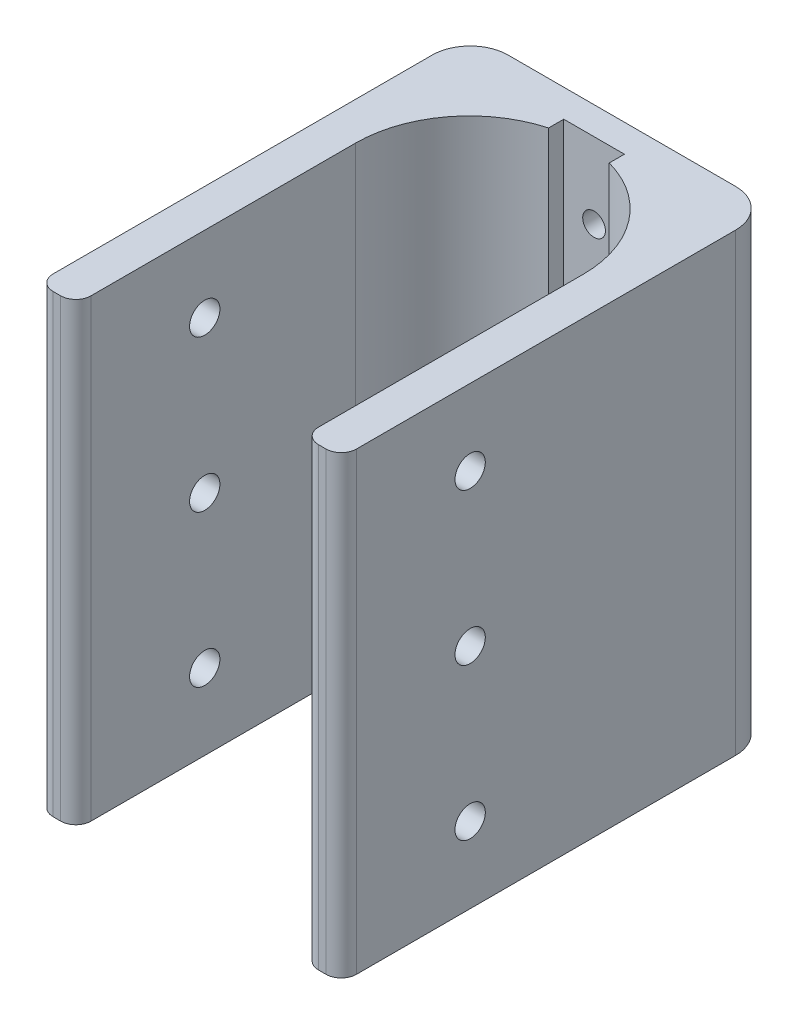
ISO-10303-21;
HEADER;
FILE_DESCRIPTION(('STEP AP214'),'2;1');
FILE_NAME('part.step','',(''),(''),'','','');
FILE_SCHEMA(('AUTOMOTIVE_DESIGN { 1 0 10303 214 1 1 1 1 }'));
ENDSEC;
DATA;
#1=APPLICATION_CONTEXT('core data for automotive mechanical design processes');
#2=APPLICATION_PROTOCOL_DEFINITION('international standard','automotive_design',2000,#1);
#3=PRODUCT_CONTEXT('',#1,'mechanical');
#4=PRODUCT('Part','Part','',(#3));
#5=PRODUCT_RELATED_PRODUCT_CATEGORY('part','',(#4));
#6=PRODUCT_DEFINITION_FORMATION('','',#4);
#7=PRODUCT_DEFINITION_CONTEXT('part definition',#1,'design');
#8=PRODUCT_DEFINITION('design','',#6,#7);
#9=PRODUCT_DEFINITION_SHAPE('','',#8);
#10=(LENGTH_UNIT() NAMED_UNIT(*) SI_UNIT(.MILLI.,.METRE.));
#11=(NAMED_UNIT(*) PLANE_ANGLE_UNIT() SI_UNIT($,.RADIAN.));
#12=(NAMED_UNIT(*) SI_UNIT($,.STERADIAN.) SOLID_ANGLE_UNIT());
#13=UNCERTAINTY_MEASURE_WITH_UNIT(LENGTH_MEASURE(1.E-05),#10,'distance_accuracy_value','');
#14=(GEOMETRIC_REPRESENTATION_CONTEXT(3) GLOBAL_UNCERTAINTY_ASSIGNED_CONTEXT((#13)) GLOBAL_UNIT_ASSIGNED_CONTEXT((#10,
#11,#12)) REPRESENTATION_CONTEXT('',''));
#15=CARTESIAN_POINT('',(0.,0.,0.));
#16=DIRECTION('',(0.,0.,1.));
#17=DIRECTION('',(1.,0.,0.));
#18=AXIS2_PLACEMENT_3D('',#15,#16,#17);
#19=CARTESIAN_POINT('',(0.,60.,42.9796640195393));
#20=DIRECTION('',(0.,0.,-1.));
#21=DIRECTION('',(-1.,0.,0.));
#22=AXIS2_PLACEMENT_3D('',#19,#20,#21);
#23=PLANE('',#22);
#24=DIRECTION('',(1.,0.,0.));
#25=VECTOR('',#24,1.);
#26=CARTESIAN_POINT('',(0.,0.,42.9796640195393));
#27=LINE('',#26,#25);
#28=CARTESIAN_POINT('',(-1.28866230415643,0.,42.9796640195393));
#29=VERTEX_POINT('',#28);
#30=CARTESIAN_POINT('',(-0.288662304156454,0.,42.9796640195393));
#31=VERTEX_POINT('',#30);
#32=EDGE_CURVE('E209',#29,#31,#27,.T.);
#33=ORIENTED_EDGE('',*,*,#32,.T.);
#34=DIRECTION('',(0.,-1.,0.));
#35=VECTOR('',#34,1.);
#36=CARTESIAN_POINT('',(-0.288662304156454,60.,42.9796640195393));
#37=LINE('',#36,#35);
#38=CARTESIAN_POINT('',(-0.288662304156454,60.,42.9796640195393));
#39=VERTEX_POINT('',#38);
#40=EDGE_CURVE('E13',#39,#31,#37,.T.);
#41=ORIENTED_EDGE('',*,*,#40,.F.);
#42=DIRECTION('',(1.,0.,0.));
#43=VECTOR('',#42,1.);
#44=CARTESIAN_POINT('',(0.,60.,42.9796640195393));
#45=LINE('',#44,#43);
#46=CARTESIAN_POINT('',(-1.28866230415643,60.,42.9796640195393));
#47=VERTEX_POINT('',#46);
#48=EDGE_CURVE('E253',#47,#39,#45,.T.);
#49=ORIENTED_EDGE('',*,*,#48,.F.);
#50=DIRECTION('',(0.,-1.,0.));
#51=VECTOR('',#50,1.);
#52=CARTESIAN_POINT('',(-1.28866230415643,60.,42.9796640195393));
#53=LINE('',#52,#51);
#54=EDGE_CURVE('E205',#47,#29,#53,.T.);
#55=ORIENTED_EDGE('',*,*,#54,.T.);
#56=EDGE_LOOP('',(#33,#41,#49,#55));
#57=FACE_BOUND('',#56,.T.);
#58=ADVANCED_FACE('F50',(#57),#23,.F.);
#59=CARTESIAN_POINT('',(-0.28866230415644,60.,40.9796640195393));
#60=DIRECTION('',(0.,-1.,0.));
#61=DIRECTION('',(0.,0.,-1.));
#62=AXIS2_PLACEMENT_3D('',#59,#60,#61);
#63=CYLINDRICAL_SURFACE('',#62,2.);
#64=CARTESIAN_POINT('',(-0.28866230415644,0.,40.9796640195393));
#65=DIRECTION('',(0.,1.,0.));
#66=DIRECTION('',(0.,0.,1.));
#67=AXIS2_PLACEMENT_3D('',#64,#65,#66);
#68=CIRCLE('',#67,2.);
#69=CARTESIAN_POINT('',(1.71133769584356,0.,40.9796640195393));
#70=VERTEX_POINT('',#69);
#71=EDGE_CURVE('E212',#31,#70,#68,.T.);
#72=ORIENTED_EDGE('',*,*,#71,.T.);
#73=DIRECTION('',(0.,-1.,0.));
#74=VECTOR('',#73,1.);
#75=CARTESIAN_POINT('',(1.71133769584356,60.,40.9796640195393));
#76=LINE('',#75,#74);
#77=CARTESIAN_POINT('',(1.71133769584356,60.,40.9796640195393));
#78=VERTEX_POINT('',#77);
#79=EDGE_CURVE('E59',#78,#70,#76,.T.);
#80=ORIENTED_EDGE('',*,*,#79,.F.);
#81=CARTESIAN_POINT('',(-0.28866230415644,60.,40.9796640195393));
#82=DIRECTION('',(0.,1.,0.));
#83=DIRECTION('',(0.,0.,1.));
#84=AXIS2_PLACEMENT_3D('',#81,#82,#83);
#85=CIRCLE('',#84,2.);
#86=EDGE_CURVE('E141',#39,#78,#85,.T.);
#87=ORIENTED_EDGE('',*,*,#86,.F.);
#88=ORIENTED_EDGE('',*,*,#40,.T.);
#89=EDGE_LOOP('',(#72,#80,#87,#88));
#90=FACE_BOUND('',#89,.T.);
#91=ADVANCED_FACE('F381',(#90),#63,.T.);
#92=CARTESIAN_POINT('',(1.71133769584356,60.,0.));
#93=DIRECTION('',(1.,0.,0.));
#94=DIRECTION('',(0.,0.,-1.));
#95=AXIS2_PLACEMENT_3D('',#92,#93,#94);
#96=PLANE('',#95);
#97=CARTESIAN_POINT('',(1.71133769584356,10.,25.9796640195393));
#98=DIRECTION('',(-1.,0.,0.));
#99=DIRECTION('',(0.,0.,1.));
#100=AXIS2_PLACEMENT_3D('',#97,#98,#99);
#101=CIRCLE('',#100,2.);
#102=CARTESIAN_POINT('',(1.71133769584356,10.,27.9796640195393));
#103=VERTEX_POINT('',#102);
#104=EDGE_CURVE('E289',#103,#103,#101,.T.);
#105=ORIENTED_EDGE('',*,*,#104,.T.);
#106=EDGE_LOOP('',(#105));
#107=FACE_BOUND('',#106,.T.);
#108=CARTESIAN_POINT('',(1.71133769584356,30.,25.9796640195393));
#109=DIRECTION('',(-1.,0.,0.));
#110=DIRECTION('',(0.,0.,1.));
#111=AXIS2_PLACEMENT_3D('',#108,#109,#110);
#112=CIRCLE('',#111,2.);
#113=CARTESIAN_POINT('',(1.71133769584356,30.,27.9796640195393));
#114=VERTEX_POINT('',#113);
#115=EDGE_CURVE('E468',#114,#114,#112,.T.);
#116=ORIENTED_EDGE('',*,*,#115,.T.);
#117=EDGE_LOOP('',(#116));
#118=FACE_BOUND('',#117,.T.);
#119=CARTESIAN_POINT('',(1.71133769584356,50.,25.9796640195393));
#120=DIRECTION('',(-1.,0.,0.));
#121=DIRECTION('',(0.,0.,1.));
#122=AXIS2_PLACEMENT_3D('',#119,#120,#121);
#123=CIRCLE('',#122,2.00000000000001);
#124=CARTESIAN_POINT('',(1.71133769584356,50.,27.9796640195393));
#125=VERTEX_POINT('',#124);
#126=EDGE_CURVE('E302',#125,#125,#123,.T.);
#127=ORIENTED_EDGE('',*,*,#126,.T.);
#128=EDGE_LOOP('',(#127));
#129=FACE_BOUND('',#128,.T.);
#130=DIRECTION('',(0.,0.,1.));
#131=VECTOR('',#130,1.);
#132=CARTESIAN_POINT('',(1.71133769584356,0.,0.));
#133=LINE('',#132,#131);
#134=CARTESIAN_POINT('',(1.71133769584356,0.,-9.02033598046068));
#135=VERTEX_POINT('',#134);
#136=EDGE_CURVE('E216',#135,#70,#133,.T.);
#137=ORIENTED_EDGE('',*,*,#136,.F.);
#138=DIRECTION('',(0.,-1.,0.));
#139=VECTOR('',#138,1.);
#140=CARTESIAN_POINT('',(1.71133769584356,60.,-9.02033598046068));
#141=LINE('',#140,#139);
#142=CARTESIAN_POINT('',(1.71133769584356,60.,-9.02033598046068));
#143=VERTEX_POINT('',#142);
#144=EDGE_CURVE('E283',#143,#135,#141,.T.);
#145=ORIENTED_EDGE('',*,*,#144,.F.);
#146=DIRECTION('',(0.,0.,1.));
#147=VECTOR('',#146,1.);
#148=CARTESIAN_POINT('',(1.71133769584356,60.,0.));
#149=LINE('',#148,#147);
#150=EDGE_CURVE('E327',#143,#78,#149,.T.);
#151=ORIENTED_EDGE('',*,*,#150,.T.);
#152=ORIENTED_EDGE('',*,*,#79,.T.);
#153=EDGE_LOOP('',(#137,#145,#151,#152));
#154=FACE_BOUND('',#153,.T.);
#155=ADVANCED_FACE('F386',(#107,#118,#129,#154),#96,.T.);
#156=CARTESIAN_POINT('',(-3.28866230415644,60.,-9.02033598046072));
#157=DIRECTION('',(0.,-1.,0.));
#158=DIRECTION('',(0.,0.,-1.));
#159=AXIS2_PLACEMENT_3D('',#156,#157,#158);
#160=CYLINDRICAL_SURFACE('',#159,5.);
#161=CARTESIAN_POINT('',(-3.28866230415644,0.,-9.02033598046072));
#162=DIRECTION('',(0.,1.,0.));
#163=DIRECTION('',(0.,0.,1.));
#164=AXIS2_PLACEMENT_3D('',#161,#162,#163);
#165=CIRCLE('',#164,5.);
#166=CARTESIAN_POINT('',(-3.28866230415647,0.,-14.0203359804607));
#167=VERTEX_POINT('',#166);
#168=EDGE_CURVE('E219',#135,#167,#165,.T.);
#169=ORIENTED_EDGE('',*,*,#168,.T.);
#170=DIRECTION('',(0.,-1.,0.));
#171=VECTOR('',#170,1.);
#172=CARTESIAN_POINT('',(-3.28866230415647,60.,-14.0203359804607));
#173=LINE('',#172,#171);
#174=CARTESIAN_POINT('',(-3.28866230415647,60.,-14.0203359804607));
#175=VERTEX_POINT('',#174);
#176=EDGE_CURVE('E281',#175,#167,#173,.T.);
#177=ORIENTED_EDGE('',*,*,#176,.F.);
#178=CARTESIAN_POINT('',(-3.28866230415644,60.,-9.02033598046072));
#179=DIRECTION('',(0.,1.,0.));
#180=DIRECTION('',(0.,0.,1.));
#181=AXIS2_PLACEMENT_3D('',#178,#179,#180);
#182=CIRCLE('',#181,5.);
#183=EDGE_CURVE('E330',#143,#175,#182,.T.);
#184=ORIENTED_EDGE('',*,*,#183,.F.);
#185=ORIENTED_EDGE('',*,*,#144,.T.);
#186=EDGE_LOOP('',(#169,#177,#184,#185));
#187=FACE_BOUND('',#186,.T.);
#188=ADVANCED_FACE('F397',(#187),#160,.T.);
#189=CARTESIAN_POINT('',(0.,60.,-14.0203359804607));
#190=DIRECTION('',(0.,0.,-1.));
#191=DIRECTION('',(-1.,0.,0.));
#192=AXIS2_PLACEMENT_3D('',#189,#190,#191);
#193=PLANE('',#192);
#194=CARTESIAN_POINT('',(-18.2886623041564,50.,-14.0203359804607));
#195=DIRECTION('',(0.,0.,-1.));
#196=DIRECTION('',(-1.,0.,0.));
#197=AXIS2_PLACEMENT_3D('',#194,#195,#196);
#198=CIRCLE('',#197,1.5);
#199=CARTESIAN_POINT('',(-19.7886623041564,50.,-14.0203359804607));
#200=VERTEX_POINT('',#199);
#201=EDGE_CURVE('E213',#200,#200,#198,.T.);
#202=ORIENTED_EDGE('',*,*,#201,.F.);
#203=EDGE_LOOP('',(#202));
#204=FACE_BOUND('',#203,.T.);
#205=CARTESIAN_POINT('',(-18.2886623041564,30.,-14.0203359804607));
#206=DIRECTION('',(0.,0.,-1.));
#207=DIRECTION('',(-1.,0.,0.));
#208=AXIS2_PLACEMENT_3D('',#205,#206,#207);
#209=CIRCLE('',#208,1.5);
#210=CARTESIAN_POINT('',(-19.7886623041564,30.,-14.0203359804607));
#211=VERTEX_POINT('',#210);
#212=EDGE_CURVE('E320',#211,#211,#209,.T.);
#213=ORIENTED_EDGE('',*,*,#212,.F.);
#214=EDGE_LOOP('',(#213));
#215=FACE_BOUND('',#214,.T.);
#216=CARTESIAN_POINT('',(-18.2886623041564,10.,-14.0203359804607));
#217=DIRECTION('',(0.,0.,-1.));
#218=DIRECTION('',(-1.,0.,0.));
#219=AXIS2_PLACEMENT_3D('',#216,#217,#218);
#220=CIRCLE('',#219,1.5);
#221=CARTESIAN_POINT('',(-19.7886623041564,10.,-14.0203359804607));
#222=VERTEX_POINT('',#221);
#223=EDGE_CURVE('E312',#222,#222,#220,.T.);
#224=ORIENTED_EDGE('',*,*,#223,.F.);
#225=EDGE_LOOP('',(#224));
#226=FACE_BOUND('',#225,.T.);
#227=DIRECTION('',(1.,0.,0.));
#228=VECTOR('',#227,1.);
#229=CARTESIAN_POINT('',(0.,0.,-14.0203359804607));
#230=LINE('',#229,#228);
#231=CARTESIAN_POINT('',(-33.2886623041564,0.,-14.0203359804607));
#232=VERTEX_POINT('',#231);
#233=EDGE_CURVE('E222',#232,#167,#230,.T.);
#234=ORIENTED_EDGE('',*,*,#233,.F.);
#235=DIRECTION('',(0.,-1.,0.));
#236=VECTOR('',#235,1.);
#237=CARTESIAN_POINT('',(-33.2886623041564,60.,-14.0203359804607));
#238=LINE('',#237,#236);
#239=CARTESIAN_POINT('',(-33.2886623041564,60.,-14.0203359804607));
#240=VERTEX_POINT('',#239);
#241=EDGE_CURVE('E279',#240,#232,#238,.T.);
#242=ORIENTED_EDGE('',*,*,#241,.F.);
#243=DIRECTION('',(1.,0.,0.));
#244=VECTOR('',#243,1.);
#245=CARTESIAN_POINT('',(0.,60.,-14.0203359804607));
#246=LINE('',#245,#244);
#247=EDGE_CURVE('E332',#240,#175,#246,.T.);
#248=ORIENTED_EDGE('',*,*,#247,.T.);
#249=ORIENTED_EDGE('',*,*,#176,.T.);
#250=EDGE_LOOP('',(#234,#242,#248,#249));
#251=FACE_BOUND('',#250,.T.);
#252=ADVANCED_FACE('F400',(#204,#215,#226,#251),#193,.T.);
#253=CARTESIAN_POINT('',(-33.2886623041564,60.,-9.02033598046071));
#254=DIRECTION('',(0.,-1.,0.));
#255=DIRECTION('',(0.,0.,-1.));
#256=AXIS2_PLACEMENT_3D('',#253,#254,#255);
#257=CYLINDRICAL_SURFACE('',#256,5.);
#258=CARTESIAN_POINT('',(-33.2886623041564,0.,-9.02033598046071));
#259=DIRECTION('',(0.,1.,0.));
#260=DIRECTION('',(0.,0.,1.));
#261=AXIS2_PLACEMENT_3D('',#258,#259,#260);
#262=CIRCLE('',#261,5.);
#263=CARTESIAN_POINT('',(-38.2886623041564,0.,-9.02033598046067));
#264=VERTEX_POINT('',#263);
#265=EDGE_CURVE('E225',#232,#264,#262,.T.);
#266=ORIENTED_EDGE('',*,*,#265,.T.);
#267=DIRECTION('',(0.,-1.,0.));
#268=VECTOR('',#267,1.);
#269=CARTESIAN_POINT('',(-38.2886623041564,60.,-9.02033598046067));
#270=LINE('',#269,#268);
#271=CARTESIAN_POINT('',(-38.2886623041564,60.,-9.02033598046067));
#272=VERTEX_POINT('',#271);
#273=EDGE_CURVE('E276',#272,#264,#270,.T.);
#274=ORIENTED_EDGE('',*,*,#273,.F.);
#275=CARTESIAN_POINT('',(-33.2886623041564,60.,-9.02033598046071));
#276=DIRECTION('',(0.,1.,0.));
#277=DIRECTION('',(0.,0.,1.));
#278=AXIS2_PLACEMENT_3D('',#275,#276,#277);
#279=CIRCLE('',#278,5.);
#280=EDGE_CURVE('E335',#240,#272,#279,.T.);
#281=ORIENTED_EDGE('',*,*,#280,.F.);
#282=ORIENTED_EDGE('',*,*,#241,.T.);
#283=EDGE_LOOP('',(#266,#274,#281,#282));
#284=FACE_BOUND('',#283,.T.);
#285=ADVANCED_FACE('F405',(#284),#257,.T.);
#286=CARTESIAN_POINT('',(-38.2886623041564,60.,0.));
#287=DIRECTION('',(1.,0.,0.));
#288=DIRECTION('',(0.,0.,-1.));
#289=AXIS2_PLACEMENT_3D('',#286,#287,#288);
#290=PLANE('',#289);
#291=CARTESIAN_POINT('',(-38.2886623041564,10.,25.9796640195393));
#292=DIRECTION('',(-1.,0.,0.));
#293=DIRECTION('',(0.,0.,1.));
#294=AXIS2_PLACEMENT_3D('',#291,#292,#293);
#295=CIRCLE('',#294,2.);
#296=CARTESIAN_POINT('',(-38.2886623041564,10.,27.9796640195393));
#297=VERTEX_POINT('',#296);
#298=EDGE_CURVE('E481',#297,#297,#295,.T.);
#299=ORIENTED_EDGE('',*,*,#298,.F.);
#300=EDGE_LOOP('',(#299));
#301=FACE_BOUND('',#300,.T.);
#302=CARTESIAN_POINT('',(-38.2886623041564,30.,25.9796640195393));
#303=DIRECTION('',(-1.,0.,0.));
#304=DIRECTION('',(0.,0.,1.));
#305=AXIS2_PLACEMENT_3D('',#302,#303,#304);
#306=CIRCLE('',#305,2.);
#307=CARTESIAN_POINT('',(-38.2886623041564,30.,27.9796640195393));
#308=VERTEX_POINT('',#307);
#309=EDGE_CURVE('E476',#308,#308,#306,.T.);
#310=ORIENTED_EDGE('',*,*,#309,.F.);
#311=EDGE_LOOP('',(#310));
#312=FACE_BOUND('',#311,.T.);
#313=CARTESIAN_POINT('',(-38.2886623041564,50.,25.9796640195393));
#314=DIRECTION('',(-1.,0.,0.));
#315=DIRECTION('',(0.,0.,1.));
#316=AXIS2_PLACEMENT_3D('',#313,#314,#315);
#317=CIRCLE('',#316,2.00000000000001);
#318=CARTESIAN_POINT('',(-38.2886623041564,50.,27.9796640195393));
#319=VERTEX_POINT('',#318);
#320=EDGE_CURVE('E472',#319,#319,#317,.T.);
#321=ORIENTED_EDGE('',*,*,#320,.F.);
#322=EDGE_LOOP('',(#321));
#323=FACE_BOUND('',#322,.T.);
#324=DIRECTION('',(0.,0.,1.));
#325=VECTOR('',#324,1.);
#326=CARTESIAN_POINT('',(-38.2886623041564,0.,0.));
#327=LINE('',#326,#325);
#328=CARTESIAN_POINT('',(-38.2886623041564,0.,40.9796640195393));
#329=VERTEX_POINT('',#328);
#330=EDGE_CURVE('E227',#264,#329,#327,.T.);
#331=ORIENTED_EDGE('',*,*,#330,.T.);
#332=DIRECTION('',(0.,-1.,0.));
#333=VECTOR('',#332,1.);
#334=CARTESIAN_POINT('',(-38.2886623041564,60.,40.9796640195393));
#335=LINE('',#334,#333);
#336=CARTESIAN_POINT('',(-38.2886623041564,60.,40.9796640195393));
#337=VERTEX_POINT('',#336);
#338=EDGE_CURVE('E273',#337,#329,#335,.T.);
#339=ORIENTED_EDGE('',*,*,#338,.F.);
#340=DIRECTION('',(0.,0.,1.));
#341=VECTOR('',#340,1.);
#342=CARTESIAN_POINT('',(-38.2886623041564,60.,0.));
#343=LINE('',#342,#341);
#344=EDGE_CURVE('E337',#272,#337,#343,.T.);
#345=ORIENTED_EDGE('',*,*,#344,.F.);
#346=ORIENTED_EDGE('',*,*,#273,.T.);
#347=EDGE_LOOP('',(#331,#339,#345,#346));
#348=FACE_BOUND('',#347,.T.);
#349=ADVANCED_FACE('F411',(#301,#312,#323,#348),#290,.F.);
#350=CARTESIAN_POINT('',(-36.2886623041564,60.,40.9796640195393));
#351=DIRECTION('',(0.,-1.,0.));
#352=DIRECTION('',(0.,0.,-1.));
#353=AXIS2_PLACEMENT_3D('',#350,#351,#352);
#354=CYLINDRICAL_SURFACE('',#353,2.);
#355=CARTESIAN_POINT('',(-36.2886623041564,0.,40.9796640195393));
#356=DIRECTION('',(0.,1.,0.));
#357=DIRECTION('',(0.,0.,1.));
#358=AXIS2_PLACEMENT_3D('',#355,#356,#357);
#359=CIRCLE('',#358,2.);
#360=CARTESIAN_POINT('',(-36.2886623041564,0.,42.9796640195393));
#361=VERTEX_POINT('',#360);
#362=EDGE_CURVE('E229',#329,#361,#359,.T.);
#363=ORIENTED_EDGE('',*,*,#362,.T.);
#364=DIRECTION('',(0.,-1.,0.));
#365=VECTOR('',#364,1.);
#366=CARTESIAN_POINT('',(-36.2886623041564,60.,42.9796640195393));
#367=LINE('',#366,#365);
#368=CARTESIAN_POINT('',(-36.2886623041564,60.,42.9796640195393));
#369=VERTEX_POINT('',#368);
#370=EDGE_CURVE('E270',#369,#361,#367,.T.);
#371=ORIENTED_EDGE('',*,*,#370,.F.);
#372=CARTESIAN_POINT('',(-36.2886623041564,60.,40.9796640195393));
#373=DIRECTION('',(0.,1.,0.));
#374=DIRECTION('',(0.,0.,1.));
#375=AXIS2_PLACEMENT_3D('',#372,#373,#374);
#376=CIRCLE('',#375,2.);
#377=EDGE_CURVE('E339',#337,#369,#376,.T.);
#378=ORIENTED_EDGE('',*,*,#377,.F.);
#379=ORIENTED_EDGE('',*,*,#338,.T.);
#380=EDGE_LOOP('',(#363,#371,#378,#379));
#381=FACE_BOUND('',#380,.T.);
#382=ADVANCED_FACE('F415',(#381),#354,.T.);
#383=CARTESIAN_POINT('',(0.,60.,42.9796640195393));
#384=DIRECTION('',(0.,0.,-1.));
#385=DIRECTION('',(-1.,0.,0.));
#386=AXIS2_PLACEMENT_3D('',#383,#384,#385);
#387=PLANE('',#386);
#388=DIRECTION('',(1.,0.,0.));
#389=VECTOR('',#388,1.);
#390=CARTESIAN_POINT('',(0.,0.,42.9796640195393));
#391=LINE('',#390,#389);
#392=CARTESIAN_POINT('',(-35.2886623041565,0.,42.9796640195393));
#393=VERTEX_POINT('',#392);
#394=EDGE_CURVE('E231',#361,#393,#391,.T.);
#395=ORIENTED_EDGE('',*,*,#394,.T.);
#396=DIRECTION('',(0.,-1.,0.));
#397=VECTOR('',#396,1.);
#398=CARTESIAN_POINT('',(-35.2886623041565,60.,42.9796640195393));
#399=LINE('',#398,#397);
#400=CARTESIAN_POINT('',(-35.2886623041565,60.,42.9796640195393));
#401=VERTEX_POINT('',#400);
#402=EDGE_CURVE('E268',#401,#393,#399,.T.);
#403=ORIENTED_EDGE('',*,*,#402,.F.);
#404=DIRECTION('',(1.,0.,0.));
#405=VECTOR('',#404,1.);
#406=CARTESIAN_POINT('',(0.,60.,42.9796640195393));
#407=LINE('',#406,#405);
#408=EDGE_CURVE('E341',#369,#401,#407,.T.);
#409=ORIENTED_EDGE('',*,*,#408,.F.);
#410=ORIENTED_EDGE('',*,*,#370,.T.);
#411=EDGE_LOOP('',(#395,#403,#409,#410));
#412=FACE_BOUND('',#411,.T.);
#413=ADVANCED_FACE('F420',(#412),#387,.F.);
#414=CARTESIAN_POINT('',(-35.2886623041564,60.,40.9796640195393));
#415=DIRECTION('',(0.,-1.,0.));
#416=DIRECTION('',(0.,0.,-1.));
#417=AXIS2_PLACEMENT_3D('',#414,#415,#416);
#418=CYLINDRICAL_SURFACE('',#417,2.);
#419=CARTESIAN_POINT('',(-35.2886623041564,0.,40.9796640195393));
#420=DIRECTION('',(0.,1.,0.));
#421=DIRECTION('',(0.,0.,1.));
#422=AXIS2_PLACEMENT_3D('',#419,#420,#421);
#423=CIRCLE('',#422,2.);
#424=CARTESIAN_POINT('',(-33.2886623041564,0.,40.9796640195393));
#425=VERTEX_POINT('',#424);
#426=EDGE_CURVE('E234',#425,#393,#423,.F.);
#427=ORIENTED_EDGE('',*,*,#426,.F.);
#428=DIRECTION('',(0.,-1.,0.));
#429=VECTOR('',#428,1.);
#430=CARTESIAN_POINT('',(-33.2886623041564,60.,40.9796640195393));
#431=LINE('',#430,#429);
#432=CARTESIAN_POINT('',(-33.2886623041564,60.,40.9796640195393));
#433=VERTEX_POINT('',#432);
#434=EDGE_CURVE('E266',#433,#425,#431,.T.);
#435=ORIENTED_EDGE('',*,*,#434,.F.);
#436=CARTESIAN_POINT('',(-35.2886623041564,60.,40.9796640195393));
#437=DIRECTION('',(0.,1.,0.));
#438=DIRECTION('',(0.,0.,1.));
#439=AXIS2_PLACEMENT_3D('',#436,#437,#438);
#440=CIRCLE('',#439,2.);
#441=EDGE_CURVE('E343',#433,#401,#440,.F.);
#442=ORIENTED_EDGE('',*,*,#441,.T.);
#443=ORIENTED_EDGE('',*,*,#402,.T.);
#444=EDGE_LOOP('',(#427,#435,#442,#443));
#445=FACE_BOUND('',#444,.T.);
#446=ADVANCED_FACE('F426',(#445),#418,.T.);
#447=CARTESIAN_POINT('',(-33.2886623041564,60.,0.));
#448=DIRECTION('',(-1.,0.,0.));
#449=DIRECTION('',(0.,0.,1.));
#450=AXIS2_PLACEMENT_3D('',#447,#448,#449);
#451=PLANE('',#450);
#452=CARTESIAN_POINT('',(-33.2886623041564,10.,25.9796640195393));
#453=DIRECTION('',(-1.,0.,0.));
#454=DIRECTION('',(0.,0.,1.));
#455=AXIS2_PLACEMENT_3D('',#452,#453,#454);
#456=CIRCLE('',#455,2.);
#457=CARTESIAN_POINT('',(-33.2886623041564,10.,27.9796640195393));
#458=VERTEX_POINT('',#457);
#459=EDGE_CURVE('E305',#458,#458,#456,.T.);
#460=ORIENTED_EDGE('',*,*,#459,.T.);
#461=EDGE_LOOP('',(#460));
#462=FACE_BOUND('',#461,.T.);
#463=CARTESIAN_POINT('',(-33.2886623041564,30.,25.9796640195393));
#464=DIRECTION('',(-1.,0.,0.));
#465=DIRECTION('',(0.,0.,1.));
#466=AXIS2_PLACEMENT_3D('',#463,#464,#465);
#467=CIRCLE('',#466,2.);
#468=CARTESIAN_POINT('',(-33.2886623041564,30.,27.9796640195393));
#469=VERTEX_POINT('',#468);
#470=EDGE_CURVE('E292',#469,#469,#467,.T.);
#471=ORIENTED_EDGE('',*,*,#470,.T.);
#472=EDGE_LOOP('',(#471));
#473=FACE_BOUND('',#472,.T.);
#474=CARTESIAN_POINT('',(-33.2886623041564,50.,25.9796640195393));
#475=DIRECTION('',(-1.,0.,0.));
#476=DIRECTION('',(0.,0.,1.));
#477=AXIS2_PLACEMENT_3D('',#474,#475,#476);
#478=CIRCLE('',#477,2.00000000000001);
#479=CARTESIAN_POINT('',(-33.2886623041564,50.,27.9796640195393));
#480=VERTEX_POINT('',#479);
#481=EDGE_CURVE('E288',#480,#480,#478,.T.);
#482=ORIENTED_EDGE('',*,*,#481,.T.);
#483=EDGE_LOOP('',(#482));
#484=FACE_BOUND('',#483,.T.);
#485=DIRECTION('',(0.,0.,-1.));
#486=VECTOR('',#485,1.);
#487=CARTESIAN_POINT('',(-33.2886623041564,0.,0.));
#488=LINE('',#487,#486);
#489=CARTESIAN_POINT('',(-33.2886623041564,0.,6.09314479035786));
#490=VERTEX_POINT('',#489);
#491=EDGE_CURVE('E237',#425,#490,#488,.T.);
#492=ORIENTED_EDGE('',*,*,#491,.T.);
#493=DIRECTION('',(0.,-1.,0.));
#494=VECTOR('',#493,1.);
#495=CARTESIAN_POINT('',(-33.2886623041564,60.,6.09314479035786));
#496=LINE('',#495,#494);
#497=CARTESIAN_POINT('',(-33.2886623041564,60.,6.09314479035786));
#498=VERTEX_POINT('',#497);
#499=EDGE_CURVE('E263',#498,#490,#496,.T.);
#500=ORIENTED_EDGE('',*,*,#499,.F.);
#501=DIRECTION('',(0.,0.,-1.));
#502=VECTOR('',#501,1.);
#503=CARTESIAN_POINT('',(-33.2886623041564,60.,0.));
#504=LINE('',#503,#502);
#505=EDGE_CURVE('E346',#433,#498,#504,.T.);
#506=ORIENTED_EDGE('',*,*,#505,.F.);
#507=ORIENTED_EDGE('',*,*,#434,.T.);
#508=EDGE_LOOP('',(#492,#500,#506,#507));
#509=FACE_BOUND('',#508,.T.);
#510=ADVANCED_FACE('F429',(#462,#473,#484,#509),#451,.F.);
#511=CARTESIAN_POINT('',(-18.2886623041564,60.,6.09314479035786));
#512=DIRECTION('',(0.,-1.,0.));
#513=DIRECTION('',(0.,0.,-1.));
#514=AXIS2_PLACEMENT_3D('',#511,#512,#513);
#515=CYLINDRICAL_SURFACE('',#514,15.);
#516=CARTESIAN_POINT('',(-18.2886623041564,0.,6.09314479035786));
#517=DIRECTION('',(0.,1.,0.));
#518=DIRECTION('',(0.,0.,1.));
#519=AXIS2_PLACEMENT_3D('',#516,#517,#518);
#520=CIRCLE('',#519,15.);
#521=CARTESIAN_POINT('',(-22.2886623041564,0.,-8.3636875044431));
#522=VERTEX_POINT('',#521);
#523=EDGE_CURVE('E239',#490,#522,#520,.F.);
#524=ORIENTED_EDGE('',*,*,#523,.T.);
#525=DIRECTION('',(0.,-1.,0.));
#526=VECTOR('',#525,1.);
#527=CARTESIAN_POINT('',(-22.2886623041564,60.,-8.3636875044431));
#528=LINE('',#527,#526);
#529=CARTESIAN_POINT('',(-22.2886623041564,60.,-8.3636875044431));
#530=VERTEX_POINT('',#529);
#531=EDGE_CURVE('E261',#530,#522,#528,.T.);
#532=ORIENTED_EDGE('',*,*,#531,.F.);
#533=CARTESIAN_POINT('',(-18.2886623041564,60.,6.09314479035786));
#534=DIRECTION('',(0.,1.,0.));
#535=DIRECTION('',(0.,0.,1.));
#536=AXIS2_PLACEMENT_3D('',#533,#534,#535);
#537=CIRCLE('',#536,15.);
#538=EDGE_CURVE('E348',#498,#530,#537,.F.);
#539=ORIENTED_EDGE('',*,*,#538,.F.);
#540=ORIENTED_EDGE('',*,*,#499,.T.);
#541=EDGE_LOOP('',(#524,#532,#539,#540));
#542=FACE_BOUND('',#541,.T.);
#543=ADVANCED_FACE('F431',(#542),#515,.F.);
#544=CARTESIAN_POINT('',(-22.2886623041565,60.,0.));
#545=DIRECTION('',(1.,0.,0.));
#546=DIRECTION('',(0.,0.,-1.));
#547=AXIS2_PLACEMENT_3D('',#544,#545,#546);
#548=PLANE('',#547);
#549=DIRECTION('',(0.,0.,1.));
#550=VECTOR('',#549,1.);
#551=CARTESIAN_POINT('',(-22.2886623041565,0.,0.));
#552=LINE('',#551,#550);
#553=CARTESIAN_POINT('',(-22.2886623041564,0.,-10.3636875044431));
#554=VERTEX_POINT('',#553);
#555=EDGE_CURVE('E242',#554,#522,#552,.T.);
#556=ORIENTED_EDGE('',*,*,#555,.F.);
#557=DIRECTION('',(0.,-1.,0.));
#558=VECTOR('',#557,1.);
#559=CARTESIAN_POINT('',(-22.2886623041564,60.,-10.3636875044431));
#560=LINE('',#559,#558);
#561=CARTESIAN_POINT('',(-22.2886623041564,60.,-10.3636875044431));
#562=VERTEX_POINT('',#561);
#563=EDGE_CURVE('E259',#562,#554,#560,.T.);
#564=ORIENTED_EDGE('',*,*,#563,.F.);
#565=DIRECTION('',(0.,0.,1.));
#566=VECTOR('',#565,1.);
#567=CARTESIAN_POINT('',(-22.2886623041565,60.,0.));
#568=LINE('',#567,#566);
#569=EDGE_CURVE('E350',#562,#530,#568,.T.);
#570=ORIENTED_EDGE('',*,*,#569,.T.);
#571=ORIENTED_EDGE('',*,*,#531,.T.);
#572=EDGE_LOOP('',(#556,#564,#570,#571));
#573=FACE_BOUND('',#572,.T.);
#574=ADVANCED_FACE('F363',(#573),#548,.T.);
#575=CARTESIAN_POINT('',(0.,60.,-10.3636875044431));
#576=DIRECTION('',(0.,0.,1.));
#577=DIRECTION('',(1.,0.,0.));
#578=AXIS2_PLACEMENT_3D('',#575,#576,#577);
#579=PLANE('',#578);
#580=CARTESIAN_POINT('',(-18.2886623041564,50.,-10.3636875044431));
#581=DIRECTION('',(0.,0.,1.));
#582=DIRECTION('',(1.,0.,0.));
#583=AXIS2_PLACEMENT_3D('',#580,#581,#582);
#584=CIRCLE('',#583,1.5);
#585=CARTESIAN_POINT('',(-16.7886623041564,50.,-10.3636875044431));
#586=VERTEX_POINT('',#585);
#587=EDGE_CURVE('E309',#586,#586,#584,.T.);
#588=ORIENTED_EDGE('',*,*,#587,.F.);
#589=EDGE_LOOP('',(#588));
#590=FACE_BOUND('',#589,.T.);
#591=CARTESIAN_POINT('',(-18.2886623041564,30.,-10.3636875044431));
#592=DIRECTION('',(0.,0.,1.));
#593=DIRECTION('',(1.,0.,0.));
#594=AXIS2_PLACEMENT_3D('',#591,#592,#593);
#595=CIRCLE('',#594,1.5);
#596=CARTESIAN_POINT('',(-16.7886623041564,30.,-10.3636875044431));
#597=VERTEX_POINT('',#596);
#598=EDGE_CURVE('E313',#597,#597,#595,.T.);
#599=ORIENTED_EDGE('',*,*,#598,.F.);
#600=EDGE_LOOP('',(#599));
#601=FACE_BOUND('',#600,.T.);
#602=CARTESIAN_POINT('',(-18.2886623041564,10.,-10.3636875044431));
#603=DIRECTION('',(0.,0.,1.));
#604=DIRECTION('',(1.,0.,0.));
#605=AXIS2_PLACEMENT_3D('',#602,#603,#604);
#606=CIRCLE('',#605,1.5);
#607=CARTESIAN_POINT('',(-16.7886623041564,10.,-10.3636875044431));
#608=VERTEX_POINT('',#607);
#609=EDGE_CURVE('E308',#608,#608,#606,.T.);
#610=ORIENTED_EDGE('',*,*,#609,.F.);
#611=EDGE_LOOP('',(#610));
#612=FACE_BOUND('',#611,.T.);
#613=DIRECTION('',(-1.,0.,0.));
#614=VECTOR('',#613,1.);
#615=CARTESIAN_POINT('',(0.,0.,-10.3636875044431));
#616=LINE('',#615,#614);
#617=CARTESIAN_POINT('',(-14.2886623041564,0.,-10.3636875044431));
#618=VERTEX_POINT('',#617);
#619=EDGE_CURVE('E245',#618,#554,#616,.T.);
#620=ORIENTED_EDGE('',*,*,#619,.F.);
#621=DIRECTION('',(0.,-1.,0.));
#622=VECTOR('',#621,1.);
#623=CARTESIAN_POINT('',(-14.2886623041564,60.,-10.3636875044431));
#624=LINE('',#623,#622);
#625=CARTESIAN_POINT('',(-14.2886623041564,60.,-10.3636875044431));
#626=VERTEX_POINT('',#625);
#627=EDGE_CURVE('E257',#626,#618,#624,.T.);
#628=ORIENTED_EDGE('',*,*,#627,.F.);
#629=DIRECTION('',(-1.,0.,0.));
#630=VECTOR('',#629,1.);
#631=CARTESIAN_POINT('',(0.,60.,-10.3636875044431));
#632=LINE('',#631,#630);
#633=EDGE_CURVE('E353',#626,#562,#632,.T.);
#634=ORIENTED_EDGE('',*,*,#633,.T.);
#635=ORIENTED_EDGE('',*,*,#563,.T.);
#636=EDGE_LOOP('',(#620,#628,#634,#635));
#637=FACE_BOUND('',#636,.T.);
#638=ADVANCED_FACE('F357',(#590,#601,#612,#637),#579,.T.);
#639=CARTESIAN_POINT('',(-14.2886623041564,60.,0.));
#640=DIRECTION('',(1.,0.,0.));
#641=DIRECTION('',(0.,0.,-1.));
#642=AXIS2_PLACEMENT_3D('',#639,#640,#641);
#643=PLANE('',#642);
#644=DIRECTION('',(0.,0.,1.));
#645=VECTOR('',#644,1.);
#646=CARTESIAN_POINT('',(-14.2886623041564,0.,0.));
#647=LINE('',#646,#645);
#648=CARTESIAN_POINT('',(-14.2886623041564,0.,-8.36368750444311));
#649=VERTEX_POINT('',#648);
#650=EDGE_CURVE('E248',#618,#649,#647,.T.);
#651=ORIENTED_EDGE('',*,*,#650,.T.);
#652=DIRECTION('',(0.,-1.,0.));
#653=VECTOR('',#652,1.);
#654=CARTESIAN_POINT('',(-14.2886623041564,60.,-8.36368750444311));
#655=LINE('',#654,#653);
#656=CARTESIAN_POINT('',(-14.2886623041564,60.,-8.36368750444311));
#657=VERTEX_POINT('',#656);
#658=EDGE_CURVE('E200',#657,#649,#655,.T.);
#659=ORIENTED_EDGE('',*,*,#658,.F.);
#660=DIRECTION('',(0.,0.,1.));
#661=VECTOR('',#660,1.);
#662=CARTESIAN_POINT('',(-14.2886623041564,60.,0.));
#663=LINE('',#662,#661);
#664=EDGE_CURVE('E191',#626,#657,#663,.T.);
#665=ORIENTED_EDGE('',*,*,#664,.F.);
#666=ORIENTED_EDGE('',*,*,#627,.T.);
#667=EDGE_LOOP('',(#651,#659,#665,#666));
#668=FACE_BOUND('',#667,.T.);
#669=ADVANCED_FACE('F370',(#668),#643,.F.);
#670=CARTESIAN_POINT('',(-18.2886623041564,60.,6.09314479035786));
#671=DIRECTION('',(0.,-1.,0.));
#672=DIRECTION('',(0.,0.,-1.));
#673=AXIS2_PLACEMENT_3D('',#670,#671,#672);
#674=CYLINDRICAL_SURFACE('',#673,15.);
#675=CARTESIAN_POINT('',(-18.2886623041564,0.,6.09314479035786));
#676=DIRECTION('',(0.,1.,0.));
#677=DIRECTION('',(0.,0.,1.));
#678=AXIS2_PLACEMENT_3D('',#675,#676,#677);
#679=CIRCLE('',#678,15.);
#680=CARTESIAN_POINT('',(-3.28866230415644,0.,6.09314479035786));
#681=VERTEX_POINT('',#680);
#682=EDGE_CURVE('E199',#649,#681,#679,.F.);
#683=ORIENTED_EDGE('',*,*,#682,.T.);
#684=DIRECTION('',(0.,-1.,0.));
#685=VECTOR('',#684,1.);
#686=CARTESIAN_POINT('',(-3.28866230415644,60.,6.09314479035786));
#687=LINE('',#686,#685);
#688=CARTESIAN_POINT('',(-3.28866230415644,60.,6.09314479035786));
#689=VERTEX_POINT('',#688);
#690=EDGE_CURVE('E196',#689,#681,#687,.T.);
#691=ORIENTED_EDGE('',*,*,#690,.F.);
#692=CARTESIAN_POINT('',(-18.2886623041564,60.,6.09314479035786));
#693=DIRECTION('',(0.,1.,0.));
#694=DIRECTION('',(0.,0.,1.));
#695=AXIS2_PLACEMENT_3D('',#692,#693,#694);
#696=CIRCLE('',#695,15.);
#697=EDGE_CURVE('E184',#657,#689,#696,.F.);
#698=ORIENTED_EDGE('',*,*,#697,.F.);
#699=ORIENTED_EDGE('',*,*,#658,.T.);
#700=EDGE_LOOP('',(#683,#691,#698,#699));
#701=FACE_BOUND('',#700,.T.);
#702=ADVANCED_FACE('F197',(#701),#674,.F.);
#703=CARTESIAN_POINT('',(-3.28866230415644,60.,0.));
#704=DIRECTION('',(1.,0.,0.));
#705=DIRECTION('',(0.,0.,-1.));
#706=AXIS2_PLACEMENT_3D('',#703,#704,#705);
#707=PLANE('',#706);
#708=CARTESIAN_POINT('',(-3.28866230415644,10.,25.9796640195393));
#709=DIRECTION('',(1.,0.,0.));
#710=DIRECTION('',(0.,0.,-1.));
#711=AXIS2_PLACEMENT_3D('',#708,#709,#710);
#712=CIRCLE('',#711,2.);
#713=CARTESIAN_POINT('',(-3.28866230415644,10.,23.9796640195393));
#714=VERTEX_POINT('',#713);
#715=EDGE_CURVE('E53',#714,#714,#712,.T.);
#716=ORIENTED_EDGE('',*,*,#715,.T.);
#717=EDGE_LOOP('',(#716));
#718=FACE_BOUND('',#717,.T.);
#719=CARTESIAN_POINT('',(-3.28866230415644,30.,25.9796640195393));
#720=DIRECTION('',(1.,0.,0.));
#721=DIRECTION('',(0.,0.,-1.));
#722=AXIS2_PLACEMENT_3D('',#719,#720,#721);
#723=CIRCLE('',#722,2.);
#724=CARTESIAN_POINT('',(-3.28866230415644,30.,23.9796640195393));
#725=VERTEX_POINT('',#724);
#726=EDGE_CURVE('E290',#725,#725,#723,.T.);
#727=ORIENTED_EDGE('',*,*,#726,.T.);
#728=EDGE_LOOP('',(#727));
#729=FACE_BOUND('',#728,.T.);
#730=CARTESIAN_POINT('',(-3.28866230415644,50.,25.9796640195393));
#731=DIRECTION('',(1.,0.,0.));
#732=DIRECTION('',(0.,0.,-1.));
#733=AXIS2_PLACEMENT_3D('',#730,#731,#732);
#734=CIRCLE('',#733,2.00000000000001);
#735=CARTESIAN_POINT('',(-3.28866230415644,50.,23.9796640195393));
#736=VERTEX_POINT('',#735);
#737=EDGE_CURVE('E286',#736,#736,#734,.T.);
#738=ORIENTED_EDGE('',*,*,#737,.T.);
#739=EDGE_LOOP('',(#738));
#740=FACE_BOUND('',#739,.T.);
#741=DIRECTION('',(0.,0.,1.));
#742=VECTOR('',#741,1.);
#743=CARTESIAN_POINT('',(-3.28866230415644,0.,0.));
#744=LINE('',#743,#742);
#745=CARTESIAN_POINT('',(-3.28866230415644,0.,40.9796640195393));
#746=VERTEX_POINT('',#745);
#747=EDGE_CURVE('E127',#681,#746,#744,.T.);
#748=ORIENTED_EDGE('',*,*,#747,.T.);
#749=DIRECTION('',(0.,-1.,0.));
#750=VECTOR('',#749,1.);
#751=CARTESIAN_POINT('',(-3.28866230415644,60.,40.9796640195393));
#752=LINE('',#751,#750);
#753=CARTESIAN_POINT('',(-3.28866230415644,60.,40.9796640195393));
#754=VERTEX_POINT('',#753);
#755=EDGE_CURVE('E201',#754,#746,#752,.T.);
#756=ORIENTED_EDGE('',*,*,#755,.F.);
#757=DIRECTION('',(0.,0.,1.));
#758=VECTOR('',#757,1.);
#759=CARTESIAN_POINT('',(-3.28866230415644,60.,0.));
#760=LINE('',#759,#758);
#761=EDGE_CURVE('E188',#689,#754,#760,.T.);
#762=ORIENTED_EDGE('',*,*,#761,.F.);
#763=ORIENTED_EDGE('',*,*,#690,.T.);
#764=EDGE_LOOP('',(#748,#756,#762,#763));
#765=FACE_BOUND('',#764,.T.);
#766=ADVANCED_FACE('F203',(#718,#729,#740,#765),#707,.F.);
#767=CARTESIAN_POINT('',(-1.28866230415644,60.,40.9796640195393));
#768=DIRECTION('',(0.,-1.,0.));
#769=DIRECTION('',(0.,0.,-1.));
#770=AXIS2_PLACEMENT_3D('',#767,#768,#769);
#771=CYLINDRICAL_SURFACE('',#770,2.);
#772=CARTESIAN_POINT('',(-1.28866230415644,0.,40.9796640195393));
#773=DIRECTION('',(0.,1.,0.));
#774=DIRECTION('',(0.,0.,1.));
#775=AXIS2_PLACEMENT_3D('',#772,#773,#774);
#776=CIRCLE('',#775,2.);
#777=EDGE_CURVE('E133',#746,#29,#776,.T.);
#778=ORIENTED_EDGE('',*,*,#777,.T.);
#779=ORIENTED_EDGE('',*,*,#54,.F.);
#780=CARTESIAN_POINT('',(-1.28866230415644,60.,40.9796640195393));
#781=DIRECTION('',(0.,1.,0.));
#782=DIRECTION('',(0.,0.,1.));
#783=AXIS2_PLACEMENT_3D('',#780,#781,#782);
#784=CIRCLE('',#783,2.);
#785=EDGE_CURVE('E68',#754,#47,#784,.T.);
#786=ORIENTED_EDGE('',*,*,#785,.F.);
#787=ORIENTED_EDGE('',*,*,#755,.T.);
#788=EDGE_LOOP('',(#778,#779,#786,#787));
#789=FACE_BOUND('',#788,.T.);
#790=ADVANCED_FACE('F534',(#789),#771,.T.);
#791=CARTESIAN_POINT('',(0.,60.,0.));
#792=DIRECTION('',(0.,1.,0.));
#793=DIRECTION('',(0.,0.,1.));
#794=AXIS2_PLACEMENT_3D('',#791,#792,#793);
#795=PLANE('',#794);
#796=ORIENTED_EDGE('',*,*,#48,.T.);
#797=ORIENTED_EDGE('',*,*,#86,.T.);
#798=ORIENTED_EDGE('',*,*,#150,.F.);
#799=ORIENTED_EDGE('',*,*,#183,.T.);
#800=ORIENTED_EDGE('',*,*,#247,.F.);
#801=ORIENTED_EDGE('',*,*,#280,.T.);
#802=ORIENTED_EDGE('',*,*,#344,.T.);
#803=ORIENTED_EDGE('',*,*,#377,.T.);
#804=ORIENTED_EDGE('',*,*,#408,.T.);
#805=ORIENTED_EDGE('',*,*,#441,.F.);
#806=ORIENTED_EDGE('',*,*,#505,.T.);
#807=ORIENTED_EDGE('',*,*,#538,.T.);
#808=ORIENTED_EDGE('',*,*,#569,.F.);
#809=ORIENTED_EDGE('',*,*,#633,.F.);
#810=ORIENTED_EDGE('',*,*,#664,.T.);
#811=ORIENTED_EDGE('',*,*,#697,.T.);
#812=ORIENTED_EDGE('',*,*,#761,.T.);
#813=ORIENTED_EDGE('',*,*,#785,.T.);
#814=EDGE_LOOP('',(#796,#797,#798,#799,#800,#801,#802,#803,#804,#805,#806,#807,#808,#809,#810,
#811,#812,#813));
#815=FACE_BOUND('',#814,.T.);
#816=ADVANCED_FACE('F186',(#815),#795,.T.);
#817=CARTESIAN_POINT('',(0.,0.,0.));
#818=DIRECTION('',(0.,1.,0.));
#819=DIRECTION('',(0.,0.,1.));
#820=AXIS2_PLACEMENT_3D('',#817,#818,#819);
#821=PLANE('',#820);
#822=ORIENTED_EDGE('',*,*,#32,.F.);
#823=ORIENTED_EDGE('',*,*,#777,.F.);
#824=ORIENTED_EDGE('',*,*,#747,.F.);
#825=ORIENTED_EDGE('',*,*,#682,.F.);
#826=ORIENTED_EDGE('',*,*,#650,.F.);
#827=ORIENTED_EDGE('',*,*,#619,.T.);
#828=ORIENTED_EDGE('',*,*,#555,.T.);
#829=ORIENTED_EDGE('',*,*,#523,.F.);
#830=ORIENTED_EDGE('',*,*,#491,.F.);
#831=ORIENTED_EDGE('',*,*,#426,.T.);
#832=ORIENTED_EDGE('',*,*,#394,.F.);
#833=ORIENTED_EDGE('',*,*,#362,.F.);
#834=ORIENTED_EDGE('',*,*,#330,.F.);
#835=ORIENTED_EDGE('',*,*,#265,.F.);
#836=ORIENTED_EDGE('',*,*,#233,.T.);
#837=ORIENTED_EDGE('',*,*,#168,.F.);
#838=ORIENTED_EDGE('',*,*,#136,.T.);
#839=ORIENTED_EDGE('',*,*,#71,.F.);
#840=EDGE_LOOP('',(#822,#823,#824,#825,#826,#827,#828,#829,#830,#831,#832,#833,#834,#835,#836,
#837,#838,#839));
#841=FACE_BOUND('',#840,.T.);
#842=ADVANCED_FACE('F368',(#841),#821,.F.);
#843=CARTESIAN_POINT('',(-18.2886623041564,10.,-20.3636875044431));
#844=DIRECTION('',(0.,0.,1.));
#845=DIRECTION('',(1.,0.,0.));
#846=AXIS2_PLACEMENT_3D('',#843,#844,#845);
#847=CYLINDRICAL_SURFACE('',#846,1.5);
#848=ORIENTED_EDGE('',*,*,#223,.T.);
#849=EDGE_LOOP('',(#848));
#850=FACE_BOUND('',#849,.T.);
#851=ORIENTED_EDGE('',*,*,#609,.T.);
#852=EDGE_LOOP('',(#851));
#853=FACE_BOUND('',#852,.T.);
#854=ADVANCED_FACE('F527',(#850,#853),#847,.F.);
#855=CARTESIAN_POINT('',(-18.2886623041564,30.,-20.3636875044431));
#856=DIRECTION('',(0.,0.,1.));
#857=DIRECTION('',(1.,0.,0.));
#858=AXIS2_PLACEMENT_3D('',#855,#856,#857);
#859=CYLINDRICAL_SURFACE('',#858,1.5);
#860=ORIENTED_EDGE('',*,*,#212,.T.);
#861=EDGE_LOOP('',(#860));
#862=FACE_BOUND('',#861,.T.);
#863=ORIENTED_EDGE('',*,*,#598,.T.);
#864=EDGE_LOOP('',(#863));
#865=FACE_BOUND('',#864,.T.);
#866=ADVANCED_FACE('F520',(#862,#865),#859,.F.);
#867=CARTESIAN_POINT('',(-18.2886623041564,50.,-20.3636875044431));
#868=DIRECTION('',(0.,0.,1.));
#869=DIRECTION('',(1.,0.,0.));
#870=AXIS2_PLACEMENT_3D('',#867,#868,#869);
#871=CYLINDRICAL_SURFACE('',#870,1.5);
#872=ORIENTED_EDGE('',*,*,#201,.T.);
#873=EDGE_LOOP('',(#872));
#874=FACE_BOUND('',#873,.T.);
#875=ORIENTED_EDGE('',*,*,#587,.T.);
#876=EDGE_LOOP('',(#875));
#877=FACE_BOUND('',#876,.T.);
#878=ADVANCED_FACE('F515',(#874,#877),#871,.F.);
#879=CARTESIAN_POINT('',(1.71133769584356,50.,25.9796640195393));
#880=DIRECTION('',(-1.,0.,0.));
#881=DIRECTION('',(0.,0.,1.));
#882=AXIS2_PLACEMENT_3D('',#879,#880,#881);
#883=CYLINDRICAL_SURFACE('',#882,2.00000000000001);
#884=ORIENTED_EDGE('',*,*,#126,.F.);
#885=EDGE_LOOP('',(#884));
#886=FACE_BOUND('',#885,.T.);
#887=ORIENTED_EDGE('',*,*,#737,.F.);
#888=EDGE_LOOP('',(#887));
#889=FACE_BOUND('',#888,.T.);
#890=ADVANCED_FACE('F507',(#886,#889),#883,.F.);
#891=CARTESIAN_POINT('',(1.71133769584356,30.,25.9796640195393));
#892=DIRECTION('',(-1.,0.,0.));
#893=DIRECTION('',(0.,0.,1.));
#894=AXIS2_PLACEMENT_3D('',#891,#892,#893);
#895=CYLINDRICAL_SURFACE('',#894,2.);
#896=ORIENTED_EDGE('',*,*,#115,.F.);
#897=EDGE_LOOP('',(#896));
#898=FACE_BOUND('',#897,.T.);
#899=ORIENTED_EDGE('',*,*,#726,.F.);
#900=EDGE_LOOP('',(#899));
#901=FACE_BOUND('',#900,.T.);
#902=ADVANCED_FACE('F497',(#898,#901),#895,.F.);
#903=CARTESIAN_POINT('',(1.71133769584356,10.,25.9796640195393));
#904=DIRECTION('',(-1.,0.,0.));
#905=DIRECTION('',(0.,0.,1.));
#906=AXIS2_PLACEMENT_3D('',#903,#904,#905);
#907=CYLINDRICAL_SURFACE('',#906,2.);
#908=ORIENTED_EDGE('',*,*,#104,.F.);
#909=EDGE_LOOP('',(#908));
#910=FACE_BOUND('',#909,.T.);
#911=ORIENTED_EDGE('',*,*,#715,.F.);
#912=EDGE_LOOP('',(#911));
#913=FACE_BOUND('',#912,.T.);
#914=ADVANCED_FACE('F505',(#910,#913),#907,.F.);
#915=ORIENTED_EDGE('',*,*,#320,.T.);
#916=EDGE_LOOP('',(#915));
#917=FACE_BOUND('',#916,.T.);
#918=ORIENTED_EDGE('',*,*,#481,.F.);
#919=EDGE_LOOP('',(#918));
#920=FACE_BOUND('',#919,.T.);
#921=ADVANCED_FACE('F495',(#917,#920),#883,.F.);
#922=ORIENTED_EDGE('',*,*,#309,.T.);
#923=EDGE_LOOP('',(#922));
#924=FACE_BOUND('',#923,.T.);
#925=ORIENTED_EDGE('',*,*,#470,.F.);
#926=EDGE_LOOP('',(#925));
#927=FACE_BOUND('',#926,.T.);
#928=ADVANCED_FACE('F492',(#924,#927),#895,.F.);
#929=ORIENTED_EDGE('',*,*,#298,.T.);
#930=EDGE_LOOP('',(#929));
#931=FACE_BOUND('',#930,.T.);
#932=ORIENTED_EDGE('',*,*,#459,.F.);
#933=EDGE_LOOP('',(#932));
#934=FACE_BOUND('',#933,.T.);
#935=ADVANCED_FACE('F486',(#931,#934),#907,.F.);
#936=CLOSED_SHELL('',(#58,#91,#155,#188,#252,#285,#349,#382,#413,#446,#510,#543,#574,#638,#669,
#702,#766,#790,#816,#842,#854,#866,#878,#890,#902,#914,#921,#928,#935));
#937=MANIFOLD_SOLID_BREP('B2',#936);
#938=ADVANCED_BREP_SHAPE_REPRESENTATION('',(#18,#937),#14);
#939=SHAPE_DEFINITION_REPRESENTATION(#9,#938);
ENDSEC;
END-ISO-10303-21;
